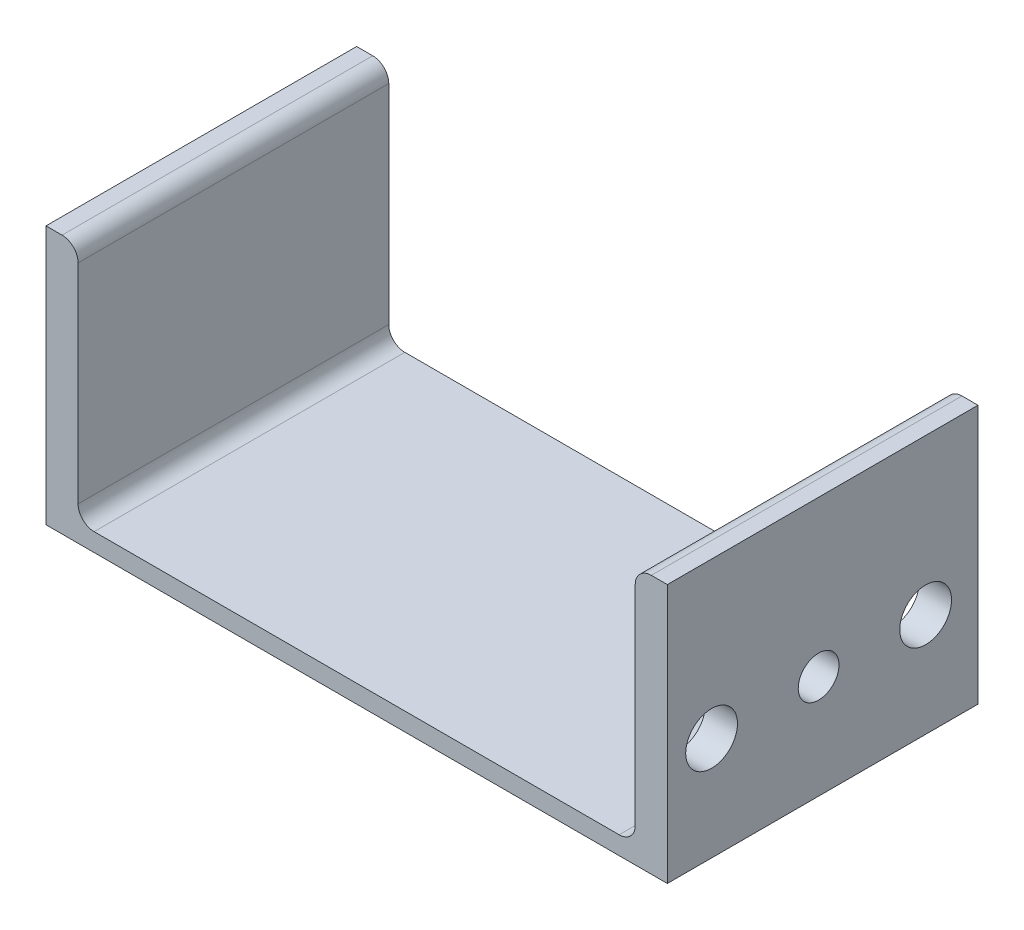
ISO-10303-21;
HEADER;
FILE_DESCRIPTION(('STEP AP214'),'2;1');
FILE_NAME('part.step','',(''),(''),'','','');
FILE_SCHEMA(('AUTOMOTIVE_DESIGN { 1 0 10303 214 1 1 1 1 }'));
ENDSEC;
DATA;
#1=APPLICATION_CONTEXT('core data for automotive mechanical design processes');
#2=APPLICATION_PROTOCOL_DEFINITION('international standard','automotive_design',2000,#1);
#3=PRODUCT_CONTEXT('',#1,'mechanical');
#4=PRODUCT('Part','Part','',(#3));
#5=PRODUCT_RELATED_PRODUCT_CATEGORY('part','',(#4));
#6=PRODUCT_DEFINITION_FORMATION('','',#4);
#7=PRODUCT_DEFINITION_CONTEXT('part definition',#1,'design');
#8=PRODUCT_DEFINITION('design','',#6,#7);
#9=PRODUCT_DEFINITION_SHAPE('','',#8);
#10=(LENGTH_UNIT() NAMED_UNIT(*) SI_UNIT(.MILLI.,.METRE.));
#11=(NAMED_UNIT(*) PLANE_ANGLE_UNIT() SI_UNIT($,.RADIAN.));
#12=(NAMED_UNIT(*) SI_UNIT($,.STERADIAN.) SOLID_ANGLE_UNIT());
#13=UNCERTAINTY_MEASURE_WITH_UNIT(LENGTH_MEASURE(1.E-05),#10,'distance_accuracy_value','');
#14=(GEOMETRIC_REPRESENTATION_CONTEXT(3) GLOBAL_UNCERTAINTY_ASSIGNED_CONTEXT((#13)) GLOBAL_UNIT_ASSIGNED_CONTEXT((#10,
#11,#12)) REPRESENTATION_CONTEXT('',''));
#15=CARTESIAN_POINT('',(0.,0.,0.));
#16=DIRECTION('',(0.,0.,1.));
#17=DIRECTION('',(1.,0.,0.));
#18=AXIS2_PLACEMENT_3D('',#15,#16,#17);
#19=CARTESIAN_POINT('',(-136.652,8.88999999999996,76.2));
#20=DIRECTION('',(-1.,0.,0.));
#21=DIRECTION('',(0.,-1.,0.));
#22=AXIS2_PLACEMENT_3D('',#19,#20,#21);
#23=PLANE('',#22);
#24=DIRECTION('',(0.,1.,0.));
#25=VECTOR('',#24,1.);
#26=CARTESIAN_POINT('',(-136.652,8.88999999999996,76.2));
#27=LINE('',#26,#25);
#28=CARTESIAN_POINT('',(-136.652,16.764,76.2));
#29=VERTEX_POINT('',#28);
#30=CARTESIAN_POINT('',(-136.652,119.126,76.2));
#31=VERTEX_POINT('',#30);
#32=EDGE_CURVE('E135',#29,#31,#27,.T.);
#33=ORIENTED_EDGE('',*,*,#32,.F.);
#34=DIRECTION('',(0.,0.,-1.));
#35=VECTOR('',#34,1.);
#36=CARTESIAN_POINT('',(-136.652,16.764,-76.2));
#37=LINE('',#36,#35);
#38=CARTESIAN_POINT('',(-136.652,16.764,-76.2));
#39=VERTEX_POINT('',#38);
#40=EDGE_CURVE('E192',#29,#39,#37,.T.);
#41=ORIENTED_EDGE('',*,*,#40,.T.);
#42=DIRECTION('',(0.,1.,0.));
#43=VECTOR('',#42,1.);
#44=CARTESIAN_POINT('',(-136.652,8.88999999999996,-76.2));
#45=LINE('',#44,#43);
#46=CARTESIAN_POINT('',(-136.652,119.126,-76.2));
#47=VERTEX_POINT('',#46);
#48=EDGE_CURVE('E166',#39,#47,#45,.T.);
#49=ORIENTED_EDGE('',*,*,#48,.T.);
#50=DIRECTION('',(0.,0.,-1.));
#51=VECTOR('',#50,1.);
#52=CARTESIAN_POINT('',(-136.652,119.126,76.2));
#53=LINE('',#52,#51);
#54=EDGE_CURVE('E144',#47,#31,#53,.F.);
#55=ORIENTED_EDGE('',*,*,#54,.T.);
#56=EDGE_LOOP('',(#33,#41,#49,#55));
#57=FACE_BOUND('',#56,.T.);
#58=ADVANCED_FACE('F38',(#57),#23,.F.);
#59=CARTESIAN_POINT('',(-136.652,127.,76.2));
#60=DIRECTION('',(0.,-1.,0.));
#61=DIRECTION('',(0.,0.,-1.));
#62=AXIS2_PLACEMENT_3D('',#59,#60,#61);
#63=PLANE('',#62);
#64=DIRECTION('',(-1.,0.,0.));
#65=VECTOR('',#64,1.);
#66=CARTESIAN_POINT('',(-136.652,127.,76.2));
#67=LINE('',#66,#65);
#68=CARTESIAN_POINT('',(-144.526,127.,76.2));
#69=VERTEX_POINT('',#68);
#70=CARTESIAN_POINT('',(-152.4,127.,76.2));
#71=VERTEX_POINT('',#70);
#72=EDGE_CURVE('E126',#69,#71,#67,.T.);
#73=ORIENTED_EDGE('',*,*,#72,.F.);
#74=DIRECTION('',(0.,0.,-1.));
#75=VECTOR('',#74,1.);
#76=CARTESIAN_POINT('',(-144.526,127.,76.2));
#77=LINE('',#76,#75);
#78=CARTESIAN_POINT('',(-144.526,127.,-76.2));
#79=VERTEX_POINT('',#78);
#80=EDGE_CURVE('E213',#69,#79,#77,.T.);
#81=ORIENTED_EDGE('',*,*,#80,.T.);
#82=DIRECTION('',(-1.,0.,0.));
#83=VECTOR('',#82,1.);
#84=CARTESIAN_POINT('',(-136.652,127.,-76.2));
#85=LINE('',#84,#83);
#86=CARTESIAN_POINT('',(-152.4,127.,-76.2));
#87=VERTEX_POINT('',#86);
#88=EDGE_CURVE('E141',#79,#87,#85,.T.);
#89=ORIENTED_EDGE('',*,*,#88,.T.);
#90=DIRECTION('',(0.,0.,-1.));
#91=VECTOR('',#90,1.);
#92=CARTESIAN_POINT('',(-152.4,127.,76.2));
#93=LINE('',#92,#91);
#94=EDGE_CURVE('E138',#71,#87,#93,.T.);
#95=ORIENTED_EDGE('',*,*,#94,.F.);
#96=EDGE_LOOP('',(#73,#81,#89,#95));
#97=FACE_BOUND('',#96,.T.);
#98=ADVANCED_FACE('F139',(#97),#63,.F.);
#99=CARTESIAN_POINT('',(-152.4,127.,76.2));
#100=DIRECTION('',(1.,0.,0.));
#101=DIRECTION('',(0.,1.,0.));
#102=AXIS2_PLACEMENT_3D('',#99,#100,#101);
#103=PLANE('',#102);
#104=DIRECTION('',(0.,-1.,0.));
#105=VECTOR('',#104,1.);
#106=CARTESIAN_POINT('',(-152.4,127.,-76.2));
#107=LINE('',#106,#105);
#108=CARTESIAN_POINT('',(-152.4,0.,-76.2));
#109=VERTEX_POINT('',#108);
#110=EDGE_CURVE('E171',#87,#109,#107,.T.);
#111=ORIENTED_EDGE('',*,*,#110,.T.);
#112=DIRECTION('',(0.,0.,-1.));
#113=VECTOR('',#112,1.);
#114=CARTESIAN_POINT('',(-152.4,0.,76.2));
#115=LINE('',#114,#113);
#116=CARTESIAN_POINT('',(-152.4,0.,76.2));
#117=VERTEX_POINT('',#116);
#118=EDGE_CURVE('E145',#117,#109,#115,.T.);
#119=ORIENTED_EDGE('',*,*,#118,.F.);
#120=DIRECTION('',(0.,-1.,0.));
#121=VECTOR('',#120,1.);
#122=CARTESIAN_POINT('',(-152.4,127.,76.2));
#123=LINE('',#122,#121);
#124=EDGE_CURVE('E130',#71,#117,#123,.T.);
#125=ORIENTED_EDGE('',*,*,#124,.F.);
#126=ORIENTED_EDGE('',*,*,#94,.T.);
#127=EDGE_LOOP('',(#111,#119,#125,#126));
#128=FACE_BOUND('',#127,.T.);
#129=ADVANCED_FACE('F147',(#128),#103,.F.);
#130=CARTESIAN_POINT('',(-152.4,0.,76.2));
#131=DIRECTION('',(0.,1.,0.));
#132=DIRECTION('',(0.,0.,1.));
#133=AXIS2_PLACEMENT_3D('',#130,#131,#132);
#134=PLANE('',#133);
#135=DIRECTION('',(1.,0.,0.));
#136=VECTOR('',#135,1.);
#137=CARTESIAN_POINT('',(-152.4,0.,-76.2));
#138=LINE('',#137,#136);
#139=CARTESIAN_POINT('',(152.4,0.,-76.2));
#140=VERTEX_POINT('',#139);
#141=EDGE_CURVE('E173',#109,#140,#138,.T.);
#142=ORIENTED_EDGE('',*,*,#141,.T.);
#143=DIRECTION('',(0.,0.,-1.));
#144=VECTOR('',#143,1.);
#145=CARTESIAN_POINT('',(152.4,0.,76.2));
#146=LINE('',#145,#144);
#147=CARTESIAN_POINT('',(152.4,0.,76.2));
#148=VERTEX_POINT('',#147);
#149=EDGE_CURVE('E187',#148,#140,#146,.T.);
#150=ORIENTED_EDGE('',*,*,#149,.F.);
#151=DIRECTION('',(1.,0.,0.));
#152=VECTOR('',#151,1.);
#153=CARTESIAN_POINT('',(-152.4,0.,76.2));
#154=LINE('',#153,#152);
#155=EDGE_CURVE('E150',#117,#148,#154,.T.);
#156=ORIENTED_EDGE('',*,*,#155,.F.);
#157=ORIENTED_EDGE('',*,*,#118,.T.);
#158=EDGE_LOOP('',(#142,#150,#156,#157));
#159=FACE_BOUND('',#158,.T.);
#160=ADVANCED_FACE('F268',(#159),#134,.F.);
#161=CARTESIAN_POINT('',(152.4,0.,76.2));
#162=DIRECTION('',(-1.,0.,0.));
#163=DIRECTION('',(0.,-1.,0.));
#164=AXIS2_PLACEMENT_3D('',#161,#162,#163);
#165=PLANE('',#164);
#166=CARTESIAN_POINT('',(152.4,50.8,-50.5068666727121));
#167=DIRECTION('',(1.,0.,0.));
#168=DIRECTION('',(0.,1.,0.));
#169=AXIS2_PLACEMENT_3D('',#166,#167,#168);
#170=CIRCLE('',#169,12.7);
#171=CARTESIAN_POINT('',(152.4,63.5,-50.5068666727121));
#172=VERTEX_POINT('',#171);
#173=EDGE_CURVE('E254',#172,#172,#170,.T.);
#174=ORIENTED_EDGE('',*,*,#173,.F.);
#175=EDGE_LOOP('',(#174));
#176=FACE_BOUND('',#175,.T.);
#177=CARTESIAN_POINT('',(152.4,50.8,54.4931333272879));
#178=DIRECTION('',(1.,0.,0.));
#179=DIRECTION('',(0.,-1.,0.));
#180=AXIS2_PLACEMENT_3D('',#177,#178,#179);
#181=CIRCLE('',#180,12.7);
#182=CARTESIAN_POINT('',(152.4,38.1,54.4931333272879));
#183=VERTEX_POINT('',#182);
#184=EDGE_CURVE('E247',#183,#183,#181,.T.);
#185=ORIENTED_EDGE('',*,*,#184,.F.);
#186=EDGE_LOOP('',(#185));
#187=FACE_BOUND('',#186,.T.);
#188=CARTESIAN_POINT('',(152.4,50.8,1.9931333272879));
#189=DIRECTION('',(1.,0.,0.));
#190=DIRECTION('',(0.,1.,0.));
#191=AXIS2_PLACEMENT_3D('',#188,#189,#190);
#192=CIRCLE('',#191,10.);
#193=CARTESIAN_POINT('',(152.4,60.8,1.9931333272879));
#194=VERTEX_POINT('',#193);
#195=EDGE_CURVE('E248',#194,#194,#192,.T.);
#196=ORIENTED_EDGE('',*,*,#195,.F.);
#197=EDGE_LOOP('',(#196));
#198=FACE_BOUND('',#197,.T.);
#199=DIRECTION('',(0.,1.,0.));
#200=VECTOR('',#199,1.);
#201=CARTESIAN_POINT('',(152.4,0.,-76.2));
#202=LINE('',#201,#200);
#203=CARTESIAN_POINT('',(152.4,127.,-76.2));
#204=VERTEX_POINT('',#203);
#205=EDGE_CURVE('E175',#140,#204,#202,.T.);
#206=ORIENTED_EDGE('',*,*,#205,.T.);
#207=DIRECTION('',(0.,0.,-1.));
#208=VECTOR('',#207,1.);
#209=CARTESIAN_POINT('',(152.4,127.,76.2));
#210=LINE('',#209,#208);
#211=CARTESIAN_POINT('',(152.4,127.,76.2));
#212=VERTEX_POINT('',#211);
#213=EDGE_CURVE('E165',#212,#204,#210,.T.);
#214=ORIENTED_EDGE('',*,*,#213,.F.);
#215=DIRECTION('',(0.,1.,0.));
#216=VECTOR('',#215,1.);
#217=CARTESIAN_POINT('',(152.4,0.,76.2));
#218=LINE('',#217,#216);
#219=EDGE_CURVE('E152',#148,#212,#218,.T.);
#220=ORIENTED_EDGE('',*,*,#219,.F.);
#221=ORIENTED_EDGE('',*,*,#149,.T.);
#222=EDGE_LOOP('',(#206,#214,#220,#221));
#223=FACE_BOUND('',#222,.T.);
#224=ADVANCED_FACE('F264',(#176,#187,#198,#223),#165,.F.);
#225=CARTESIAN_POINT('',(152.4,127.,76.2));
#226=DIRECTION('',(0.,-1.,0.));
#227=DIRECTION('',(0.,0.,-1.));
#228=AXIS2_PLACEMENT_3D('',#225,#226,#227);
#229=PLANE('',#228);
#230=DIRECTION('',(-1.,0.,0.));
#231=VECTOR('',#230,1.);
#232=CARTESIAN_POINT('',(152.4,127.,-76.2));
#233=LINE('',#232,#231);
#234=CARTESIAN_POINT('',(144.526,127.,-76.2));
#235=VERTEX_POINT('',#234);
#236=EDGE_CURVE('E177',#204,#235,#233,.T.);
#237=ORIENTED_EDGE('',*,*,#236,.T.);
#238=DIRECTION('',(0.,0.,-1.));
#239=VECTOR('',#238,1.);
#240=CARTESIAN_POINT('',(144.526,127.,76.2));
#241=LINE('',#240,#239);
#242=CARTESIAN_POINT('',(144.526,127.,76.2));
#243=VERTEX_POINT('',#242);
#244=EDGE_CURVE('E61',#235,#243,#241,.F.);
#245=ORIENTED_EDGE('',*,*,#244,.T.);
#246=DIRECTION('',(-1.,0.,0.));
#247=VECTOR('',#246,1.);
#248=CARTESIAN_POINT('',(152.4,127.,76.2));
#249=LINE('',#248,#247);
#250=EDGE_CURVE('E157',#212,#243,#249,.T.);
#251=ORIENTED_EDGE('',*,*,#250,.F.);
#252=ORIENTED_EDGE('',*,*,#213,.T.);
#253=EDGE_LOOP('',(#237,#245,#251,#252));
#254=FACE_BOUND('',#253,.T.);
#255=ADVANCED_FACE('F267',(#254),#229,.F.);
#256=CARTESIAN_POINT('',(136.652,127.,76.2));
#257=DIRECTION('',(1.,0.,0.));
#258=DIRECTION('',(0.,1.,0.));
#259=AXIS2_PLACEMENT_3D('',#256,#257,#258);
#260=PLANE('',#259);
#261=CARTESIAN_POINT('',(136.652,50.8,-50.5068666727121));
#262=DIRECTION('',(1.,0.,0.));
#263=DIRECTION('',(0.,1.,0.));
#264=AXIS2_PLACEMENT_3D('',#261,#262,#263);
#265=CIRCLE('',#264,12.7);
#266=CARTESIAN_POINT('',(136.652,63.5,-50.5068666727121));
#267=VERTEX_POINT('',#266);
#268=EDGE_CURVE('E169',#267,#267,#265,.F.);
#269=ORIENTED_EDGE('',*,*,#268,.F.);
#270=EDGE_LOOP('',(#269));
#271=FACE_BOUND('',#270,.T.);
#272=CARTESIAN_POINT('',(136.652,50.8,54.4931333272879));
#273=DIRECTION('',(1.,0.,0.));
#274=DIRECTION('',(0.,1.,0.));
#275=AXIS2_PLACEMENT_3D('',#272,#273,#274);
#276=CIRCLE('',#275,12.7);
#277=CARTESIAN_POINT('',(136.652,63.5,54.4931333272879));
#278=VERTEX_POINT('',#277);
#279=EDGE_CURVE('E251',#278,#278,#276,.F.);
#280=ORIENTED_EDGE('',*,*,#279,.F.);
#281=EDGE_LOOP('',(#280));
#282=FACE_BOUND('',#281,.T.);
#283=CARTESIAN_POINT('',(136.652,50.8,1.9931333272879));
#284=DIRECTION('',(1.,0.,0.));
#285=DIRECTION('',(0.,1.,0.));
#286=AXIS2_PLACEMENT_3D('',#283,#284,#285);
#287=CIRCLE('',#286,10.);
#288=CARTESIAN_POINT('',(136.652,60.8,1.9931333272879));
#289=VERTEX_POINT('',#288);
#290=EDGE_CURVE('E244',#289,#289,#287,.F.);
#291=ORIENTED_EDGE('',*,*,#290,.F.);
#292=EDGE_LOOP('',(#291));
#293=FACE_BOUND('',#292,.T.);
#294=DIRECTION('',(0.,-1.,0.));
#295=VECTOR('',#294,1.);
#296=CARTESIAN_POINT('',(136.652,127.,-76.2));
#297=LINE('',#296,#295);
#298=CARTESIAN_POINT('',(136.652,119.126,-76.2));
#299=VERTEX_POINT('',#298);
#300=CARTESIAN_POINT('',(136.652,16.764,-76.2));
#301=VERTEX_POINT('',#300);
#302=EDGE_CURVE('E179',#299,#301,#297,.T.);
#303=ORIENTED_EDGE('',*,*,#302,.T.);
#304=DIRECTION('',(0.,0.,-1.));
#305=VECTOR('',#304,1.);
#306=CARTESIAN_POINT('',(136.652,16.764,76.2));
#307=LINE('',#306,#305);
#308=CARTESIAN_POINT('',(136.652,16.764,76.2));
#309=VERTEX_POINT('',#308);
#310=EDGE_CURVE('E203',#301,#309,#307,.F.);
#311=ORIENTED_EDGE('',*,*,#310,.T.);
#312=DIRECTION('',(0.,-1.,0.));
#313=VECTOR('',#312,1.);
#314=CARTESIAN_POINT('',(136.652,127.,76.2));
#315=LINE('',#314,#313);
#316=CARTESIAN_POINT('',(136.652,119.126,76.2));
#317=VERTEX_POINT('',#316);
#318=EDGE_CURVE('E159',#317,#309,#315,.T.);
#319=ORIENTED_EDGE('',*,*,#318,.F.);
#320=DIRECTION('',(0.,0.,-1.));
#321=VECTOR('',#320,1.);
#322=CARTESIAN_POINT('',(136.652,119.126,76.2));
#323=LINE('',#322,#321);
#324=EDGE_CURVE('E200',#317,#299,#323,.T.);
#325=ORIENTED_EDGE('',*,*,#324,.T.);
#326=EDGE_LOOP('',(#303,#311,#319,#325));
#327=FACE_BOUND('',#326,.T.);
#328=ADVANCED_FACE('F226',(#271,#282,#293,#327),#260,.F.);
#329=CARTESIAN_POINT('',(136.652,8.88999999999996,76.2));
#330=DIRECTION('',(0.,-1.,0.));
#331=DIRECTION('',(0.,0.,-1.));
#332=AXIS2_PLACEMENT_3D('',#329,#330,#331);
#333=PLANE('',#332);
#334=DIRECTION('',(-1.,0.,0.));
#335=VECTOR('',#334,1.);
#336=CARTESIAN_POINT('',(136.652,8.88999999999996,-76.2));
#337=LINE('',#336,#335);
#338=CARTESIAN_POINT('',(128.778,8.88999999999996,-76.2));
#339=VERTEX_POINT('',#338);
#340=CARTESIAN_POINT('',(-128.778,8.88999999999996,-76.2));
#341=VERTEX_POINT('',#340);
#342=EDGE_CURVE('E182',#339,#341,#337,.T.);
#343=ORIENTED_EDGE('',*,*,#342,.T.);
#344=DIRECTION('',(0.,0.,-1.));
#345=VECTOR('',#344,1.);
#346=CARTESIAN_POINT('',(-128.778,8.88999999999996,76.2));
#347=LINE('',#346,#345);
#348=CARTESIAN_POINT('',(-128.778,8.88999999999996,76.2));
#349=VERTEX_POINT('',#348);
#350=EDGE_CURVE('E198',#341,#349,#347,.F.);
#351=ORIENTED_EDGE('',*,*,#350,.T.);
#352=DIRECTION('',(-1.,0.,0.));
#353=VECTOR('',#352,1.);
#354=CARTESIAN_POINT('',(136.652,8.88999999999996,76.2));
#355=LINE('',#354,#353);
#356=CARTESIAN_POINT('',(128.778,8.88999999999996,76.2));
#357=VERTEX_POINT('',#356);
#358=EDGE_CURVE('E162',#357,#349,#355,.T.);
#359=ORIENTED_EDGE('',*,*,#358,.F.);
#360=DIRECTION('',(0.,0.,-1.));
#361=VECTOR('',#360,1.);
#362=CARTESIAN_POINT('',(128.778,8.88999999999996,-76.2));
#363=LINE('',#362,#361);
#364=EDGE_CURVE('E195',#357,#339,#363,.T.);
#365=ORIENTED_EDGE('',*,*,#364,.T.);
#366=EDGE_LOOP('',(#343,#351,#359,#365));
#367=FACE_BOUND('',#366,.T.);
#368=ADVANCED_FACE('F234',(#367),#333,.F.);
#369=CARTESIAN_POINT('',(-136.652,127.,76.2));
#370=DIRECTION('',(0.,0.,1.));
#371=DIRECTION('',(1.,0.,0.));
#372=AXIS2_PLACEMENT_3D('',#369,#370,#371);
#373=PLANE('',#372);
#374=ORIENTED_EDGE('',*,*,#250,.T.);
#375=CARTESIAN_POINT('',(144.526,119.126,76.2));
#376=DIRECTION('',(0.,0.,1.));
#377=DIRECTION('',(1.,0.,0.));
#378=AXIS2_PLACEMENT_3D('',#375,#376,#377);
#379=CIRCLE('',#378,7.874);
#380=EDGE_CURVE('E211',#243,#317,#379,.T.);
#381=ORIENTED_EDGE('',*,*,#380,.T.);
#382=ORIENTED_EDGE('',*,*,#318,.T.);
#383=CARTESIAN_POINT('',(128.778,16.764,76.2));
#384=DIRECTION('',(0.,0.,1.));
#385=DIRECTION('',(1.,0.,0.));
#386=AXIS2_PLACEMENT_3D('',#383,#384,#385);
#387=CIRCLE('',#386,7.874);
#388=EDGE_CURVE('E11',#309,#357,#387,.F.);
#389=ORIENTED_EDGE('',*,*,#388,.T.);
#390=ORIENTED_EDGE('',*,*,#358,.T.);
#391=CARTESIAN_POINT('',(-128.778,16.764,76.2));
#392=DIRECTION('',(0.,0.,1.));
#393=DIRECTION('',(1.,0.,0.));
#394=AXIS2_PLACEMENT_3D('',#391,#392,#393);
#395=CIRCLE('',#394,7.874);
#396=EDGE_CURVE('E217',#349,#29,#395,.F.);
#397=ORIENTED_EDGE('',*,*,#396,.T.);
#398=ORIENTED_EDGE('',*,*,#32,.T.);
#399=CARTESIAN_POINT('',(-144.526,119.126,76.2));
#400=DIRECTION('',(0.,0.,1.));
#401=DIRECTION('',(1.,0.,0.));
#402=AXIS2_PLACEMENT_3D('',#399,#400,#401);
#403=CIRCLE('',#402,7.874);
#404=EDGE_CURVE('E53',#31,#69,#403,.T.);
#405=ORIENTED_EDGE('',*,*,#404,.T.);
#406=ORIENTED_EDGE('',*,*,#72,.T.);
#407=ORIENTED_EDGE('',*,*,#124,.T.);
#408=ORIENTED_EDGE('',*,*,#155,.T.);
#409=ORIENTED_EDGE('',*,*,#219,.T.);
#410=EDGE_LOOP('',(#374,#381,#382,#389,#390,#397,#398,#405,#406,#407,#408,#409));
#411=FACE_BOUND('',#410,.T.);
#412=ADVANCED_FACE('F128',(#411),#373,.T.);
#413=CARTESIAN_POINT('',(-136.652,127.,-76.2));
#414=DIRECTION('',(0.,0.,1.));
#415=DIRECTION('',(1.,0.,0.));
#416=AXIS2_PLACEMENT_3D('',#413,#414,#415);
#417=PLANE('',#416);
#418=ORIENTED_EDGE('',*,*,#302,.F.);
#419=CARTESIAN_POINT('',(144.526,119.126,-76.2));
#420=DIRECTION('',(0.,0.,1.));
#421=DIRECTION('',(1.,0.,0.));
#422=AXIS2_PLACEMENT_3D('',#419,#420,#421);
#423=CIRCLE('',#422,7.874);
#424=EDGE_CURVE('E207',#299,#235,#423,.F.);
#425=ORIENTED_EDGE('',*,*,#424,.T.);
#426=ORIENTED_EDGE('',*,*,#236,.F.);
#427=ORIENTED_EDGE('',*,*,#205,.F.);
#428=ORIENTED_EDGE('',*,*,#141,.F.);
#429=ORIENTED_EDGE('',*,*,#110,.F.);
#430=ORIENTED_EDGE('',*,*,#88,.F.);
#431=CARTESIAN_POINT('',(-144.526,119.126,-76.2));
#432=DIRECTION('',(0.,0.,1.));
#433=DIRECTION('',(1.,0.,0.));
#434=AXIS2_PLACEMENT_3D('',#431,#432,#433);
#435=CIRCLE('',#434,7.874);
#436=EDGE_CURVE('E205',#79,#47,#435,.F.);
#437=ORIENTED_EDGE('',*,*,#436,.T.);
#438=ORIENTED_EDGE('',*,*,#48,.F.);
#439=CARTESIAN_POINT('',(-128.778,16.764,-76.2));
#440=DIRECTION('',(0.,0.,1.));
#441=DIRECTION('',(1.,0.,0.));
#442=AXIS2_PLACEMENT_3D('',#439,#440,#441);
#443=CIRCLE('',#442,7.874);
#444=EDGE_CURVE('E215',#39,#341,#443,.T.);
#445=ORIENTED_EDGE('',*,*,#444,.T.);
#446=ORIENTED_EDGE('',*,*,#342,.F.);
#447=CARTESIAN_POINT('',(128.778,16.764,-76.2));
#448=DIRECTION('',(0.,0.,1.));
#449=DIRECTION('',(1.,0.,0.));
#450=AXIS2_PLACEMENT_3D('',#447,#448,#449);
#451=CIRCLE('',#450,7.874);
#452=EDGE_CURVE('E46',#339,#301,#451,.T.);
#453=ORIENTED_EDGE('',*,*,#452,.T.);
#454=EDGE_LOOP('',(#418,#425,#426,#427,#428,#429,#430,#437,#438,#445,#446,#453));
#455=FACE_BOUND('',#454,.T.);
#456=ADVANCED_FACE('F221',(#455),#417,.F.);
#457=CARTESIAN_POINT('',(-128.778,16.764,76.2));
#458=DIRECTION('',(0.,0.,1.));
#459=DIRECTION('',(1.,0.,0.));
#460=AXIS2_PLACEMENT_3D('',#457,#458,#459);
#461=CYLINDRICAL_SURFACE('',#460,7.874);
#462=ORIENTED_EDGE('',*,*,#396,.F.);
#463=ORIENTED_EDGE('',*,*,#350,.F.);
#464=ORIENTED_EDGE('',*,*,#444,.F.);
#465=ORIENTED_EDGE('',*,*,#40,.F.);
#466=EDGE_LOOP('',(#462,#463,#464,#465));
#467=FACE_BOUND('',#466,.T.);
#468=ADVANCED_FACE('F237',(#467),#461,.F.);
#469=CARTESIAN_POINT('',(128.778,16.764,76.2));
#470=DIRECTION('',(0.,0.,1.));
#471=DIRECTION('',(1.,0.,0.));
#472=AXIS2_PLACEMENT_3D('',#469,#470,#471);
#473=CYLINDRICAL_SURFACE('',#472,7.874);
#474=ORIENTED_EDGE('',*,*,#388,.F.);
#475=ORIENTED_EDGE('',*,*,#310,.F.);
#476=ORIENTED_EDGE('',*,*,#452,.F.);
#477=ORIENTED_EDGE('',*,*,#364,.F.);
#478=EDGE_LOOP('',(#474,#475,#476,#477));
#479=FACE_BOUND('',#478,.T.);
#480=ADVANCED_FACE('F230',(#479),#473,.F.);
#481=CARTESIAN_POINT('',(144.526,119.126,76.2));
#482=DIRECTION('',(0.,0.,-1.));
#483=DIRECTION('',(-1.,0.,0.));
#484=AXIS2_PLACEMENT_3D('',#481,#482,#483);
#485=CYLINDRICAL_SURFACE('',#484,7.874);
#486=ORIENTED_EDGE('',*,*,#380,.F.);
#487=ORIENTED_EDGE('',*,*,#244,.F.);
#488=ORIENTED_EDGE('',*,*,#424,.F.);
#489=ORIENTED_EDGE('',*,*,#324,.F.);
#490=EDGE_LOOP('',(#486,#487,#488,#489));
#491=FACE_BOUND('',#490,.T.);
#492=ADVANCED_FACE('F282',(#491),#485,.T.);
#493=CARTESIAN_POINT('',(-144.526,119.126,76.2));
#494=DIRECTION('',(0.,0.,-1.));
#495=DIRECTION('',(-1.,0.,0.));
#496=AXIS2_PLACEMENT_3D('',#493,#494,#495);
#497=CYLINDRICAL_SURFACE('',#496,7.874);
#498=ORIENTED_EDGE('',*,*,#404,.F.);
#499=ORIENTED_EDGE('',*,*,#54,.F.);
#500=ORIENTED_EDGE('',*,*,#436,.F.);
#501=ORIENTED_EDGE('',*,*,#80,.F.);
#502=EDGE_LOOP('',(#498,#499,#500,#501));
#503=FACE_BOUND('',#502,.T.);
#504=ADVANCED_FACE('F40',(#503),#497,.T.);
#505=CARTESIAN_POINT('',(100.730975515723,50.8,1.9931333272879));
#506=DIRECTION('',(1.,0.,0.));
#507=DIRECTION('',(0.,1.,0.));
#508=AXIS2_PLACEMENT_3D('',#505,#506,#507);
#509=CYLINDRICAL_SURFACE('',#508,10.);
#510=ORIENTED_EDGE('',*,*,#290,.T.);
#511=EDGE_LOOP('',(#510));
#512=FACE_BOUND('',#511,.T.);
#513=ORIENTED_EDGE('',*,*,#195,.T.);
#514=EDGE_LOOP('',(#513));
#515=FACE_BOUND('',#514,.T.);
#516=ADVANCED_FACE('F286',(#512,#515),#509,.F.);
#517=CARTESIAN_POINT('',(100.730975515723,50.8,54.4931333272879));
#518=DIRECTION('',(1.,0.,0.));
#519=DIRECTION('',(0.,1.,0.));
#520=AXIS2_PLACEMENT_3D('',#517,#518,#519);
#521=CYLINDRICAL_SURFACE('',#520,12.7);
#522=ORIENTED_EDGE('',*,*,#279,.T.);
#523=EDGE_LOOP('',(#522));
#524=FACE_BOUND('',#523,.T.);
#525=ORIENTED_EDGE('',*,*,#184,.T.);
#526=EDGE_LOOP('',(#525));
#527=FACE_BOUND('',#526,.T.);
#528=ADVANCED_FACE('F291',(#524,#527),#521,.F.);
#529=CARTESIAN_POINT('',(100.730975515723,50.8,-50.5068666727121));
#530=DIRECTION('',(1.,0.,0.));
#531=DIRECTION('',(0.,1.,0.));
#532=AXIS2_PLACEMENT_3D('',#529,#530,#531);
#533=CYLINDRICAL_SURFACE('',#532,12.7);
#534=ORIENTED_EDGE('',*,*,#268,.T.);
#535=EDGE_LOOP('',(#534));
#536=FACE_BOUND('',#535,.T.);
#537=ORIENTED_EDGE('',*,*,#173,.T.);
#538=EDGE_LOOP('',(#537));
#539=FACE_BOUND('',#538,.T.);
#540=ADVANCED_FACE('F262',(#536,#539),#533,.F.);
#541=CLOSED_SHELL('',(#58,#98,#129,#160,#224,#255,#328,#368,#412,#456,#468,#480,#492,#504,#516,
#528,#540));
#542=MANIFOLD_SOLID_BREP('B2',#541);
#543=ADVANCED_BREP_SHAPE_REPRESENTATION('',(#18,#542),#14);
#544=SHAPE_DEFINITION_REPRESENTATION(#9,#543);
ENDSEC;
END-ISO-10303-21;
